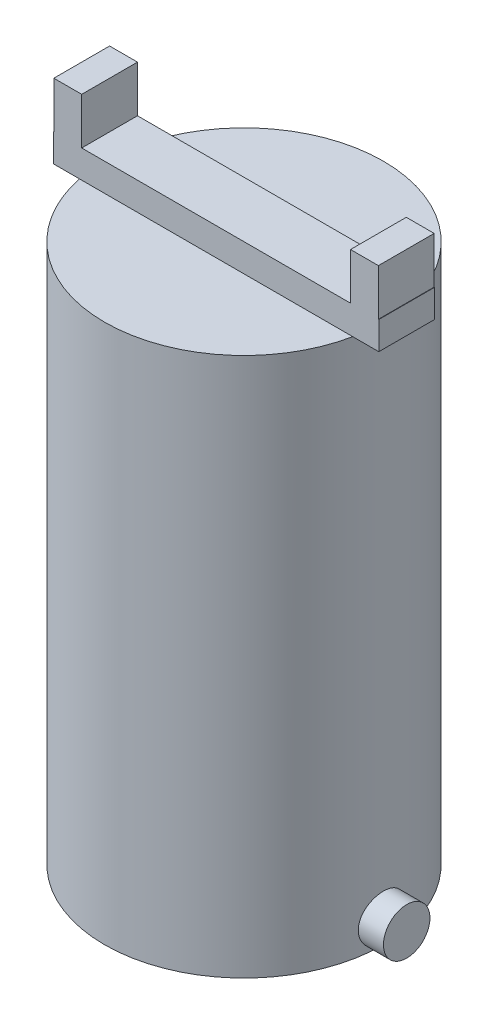
ISO-10303-21;
HEADER;
FILE_DESCRIPTION(('STEP AP214'),'2;1');
FILE_NAME('part.step','',(''),(''),'','','');
FILE_SCHEMA(('AUTOMOTIVE_DESIGN { 1 0 10303 214 1 1 1 1 }'));
ENDSEC;
DATA;
#1=APPLICATION_CONTEXT('core data for automotive mechanical design processes');
#2=APPLICATION_PROTOCOL_DEFINITION('international standard','automotive_design',2000,#1);
#3=PRODUCT_CONTEXT('',#1,'mechanical');
#4=PRODUCT('Part','Part','',(#3));
#5=PRODUCT_RELATED_PRODUCT_CATEGORY('part','',(#4));
#6=PRODUCT_DEFINITION_FORMATION('','',#4);
#7=PRODUCT_DEFINITION_CONTEXT('part definition',#1,'design');
#8=PRODUCT_DEFINITION('design','',#6,#7);
#9=PRODUCT_DEFINITION_SHAPE('','',#8);
#10=(LENGTH_UNIT() NAMED_UNIT(*) SI_UNIT(.MILLI.,.METRE.));
#11=(NAMED_UNIT(*) PLANE_ANGLE_UNIT() SI_UNIT($,.RADIAN.));
#12=(NAMED_UNIT(*) SI_UNIT($,.STERADIAN.) SOLID_ANGLE_UNIT());
#13=UNCERTAINTY_MEASURE_WITH_UNIT(LENGTH_MEASURE(1.E-05),#10,'distance_accuracy_value','');
#14=(GEOMETRIC_REPRESENTATION_CONTEXT(3) GLOBAL_UNCERTAINTY_ASSIGNED_CONTEXT((#13)) GLOBAL_UNIT_ASSIGNED_CONTEXT((#10,
#11,#12)) REPRESENTATION_CONTEXT('',''));
#15=CARTESIAN_POINT('',(0.,0.,0.));
#16=DIRECTION('',(0.,0.,1.));
#17=DIRECTION('',(1.,0.,0.));
#18=AXIS2_PLACEMENT_3D('',#15,#16,#17);
#19=CARTESIAN_POINT('',(0.,58.,0.));
#20=DIRECTION('',(0.,-1.,0.));
#21=DIRECTION('',(0.,0.,-1.));
#22=AXIS2_PLACEMENT_3D('',#19,#20,#21);
#23=CYLINDRICAL_SURFACE('',#22,15.);
#24=CARTESIAN_POINT('',(0.,58.,0.));
#25=DIRECTION('',(0.,1.,0.));
#26=DIRECTION('',(0.,0.,1.));
#27=AXIS2_PLACEMENT_3D('',#24,#25,#26);
#28=CIRCLE('',#27,15.);
#29=CARTESIAN_POINT('',(14.6969384566991,58.,3.));
#30=VERTEX_POINT('',#29);
#31=CARTESIAN_POINT('',(14.6969384566991,58.,-3.));
#32=VERTEX_POINT('',#31);
#33=EDGE_CURVE('E153',#30,#32,#28,.T.);
#34=ORIENTED_EDGE('',*,*,#33,.F.);
#35=CARTESIAN_POINT('',(-14.6969384566991,58.,3.));
#36=VERTEX_POINT('',#35);
#37=EDGE_CURVE('E151',#36,#30,#28,.T.);
#38=ORIENTED_EDGE('',*,*,#37,.F.);
#39=CARTESIAN_POINT('',(-14.6969384566991,58.,-3.));
#40=VERTEX_POINT('',#39);
#41=EDGE_CURVE('E152',#40,#36,#28,.T.);
#42=ORIENTED_EDGE('',*,*,#41,.F.);
#43=EDGE_CURVE('E158',#32,#40,#28,.T.);
#44=ORIENTED_EDGE('',*,*,#43,.F.);
#45=EDGE_LOOP('',(#34,#38,#42,#44));
#46=FACE_BOUND('',#45,.T.);
#47=CARTESIAN_POINT('',(0.,0.,0.));
#48=DIRECTION('',(0.,1.,0.));
#49=DIRECTION('',(0.,0.,1.));
#50=AXIS2_PLACEMENT_3D('',#47,#48,#49);
#51=CIRCLE('',#50,15.);
#52=CARTESIAN_POINT('',(15.,0.,0.));
#53=VERTEX_POINT('',#52);
#54=CARTESIAN_POINT('',(-15.,0.,0.));
#55=VERTEX_POINT('',#54);
#56=EDGE_CURVE('E37',#53,#55,#51,.T.);
#57=ORIENTED_EDGE('',*,*,#56,.T.);
#58=CARTESIAN_POINT('',(-15.,0.,0.));
#59=CARTESIAN_POINT('',(-14.9999976116882,5.58894783288313E-06,-0.139390904958215));
#60=CARTESIAN_POINT('',(-14.9980367791303,0.0116972749689239,-0.278857881838822));
#61=CARTESIAN_POINT('',(-14.9904034494139,0.0581356587653207,-0.553880221673044));
#62=CARTESIAN_POINT('',(-14.9847275392389,0.0929035569116028,-0.689431867959247));
#63=CARTESIAN_POINT('',(-14.9703006823645,0.184415448592755,-0.952604747212643));
#64=CARTESIAN_POINT('',(-14.9615522515919,0.241141465640574,-1.0802323684319));
#65=CARTESIAN_POINT('',(-14.9419422708207,0.374912292052395,-1.32414184197794));
#66=CARTESIAN_POINT('',(-14.9310809625443,0.451954777482997,-1.44042498987859));
#67=CARTESIAN_POINT('',(-14.9083331745831,0.624955083820459,-1.65947261429168));
#68=CARTESIAN_POINT('',(-14.8964387181486,0.721069114636129,-1.76211290353497));
#69=CARTESIAN_POINT('',(-14.8730262687673,0.929147968472811,-1.94988849865993));
#70=CARTESIAN_POINT('',(-14.8615082996267,1.04111379145661,-2.03502269939097));
#71=CARTESIAN_POINT('',(-14.8400756575978,1.27857096619706,-2.18586712560513));
#72=CARTESIAN_POINT('',(-14.8301712909164,1.40414133680476,-2.251454552861));
#73=CARTESIAN_POINT('',(-14.8131978979467,1.66470956430063,-2.36055836541122));
#74=CARTESIAN_POINT('',(-14.8061286801431,1.79970678367763,-2.40407624156561));
#75=CARTESIAN_POINT('',(-14.7957053684276,2.07398027485654,-2.46741437778481));
#76=CARTESIAN_POINT('',(-14.792317684857,2.21320573650139,-2.4874490291354));
#77=CARTESIAN_POINT('',(-14.7895393893665,2.49308027688347,-2.50391672528988));
#78=CARTESIAN_POINT('',(-14.7901484945721,2.6337292541673,-2.500351440389));
#79=CARTESIAN_POINT('',(-14.7952642886356,2.91092786127545,-2.46989509839615));
#80=CARTESIAN_POINT('',(-14.7997307331892,3.04750480354523,-2.44324488188977));
#81=CARTESIAN_POINT('',(-14.8119949521101,3.31422131782913,-2.36775314040345));
#82=CARTESIAN_POINT('',(-14.8197928407327,3.44436066888855,-2.31891085431974));
#83=CARTESIAN_POINT('',(-14.837884793341,3.69522882344092,-2.20017724609391));
#84=CARTESIAN_POINT('',(-14.8481906710733,3.81590940608123,-2.13018591387971));
#85=CARTESIAN_POINT('',(-14.8701291841501,4.04390440053838,-1.97121201755743));
#86=CARTESIAN_POINT('',(-14.8817619265429,4.15121773245493,-1.88222792065429));
#87=CARTESIAN_POINT('',(-14.9052202787979,4.35082608580735,-1.68648221215905));
#88=CARTESIAN_POINT('',(-14.9170464923165,4.44291851854008,-1.57951396387313));
#89=CARTESIAN_POINT('',(-14.9394260139672,4.60787776266534,-1.35153524898165));
#90=CARTESIAN_POINT('',(-14.9499793138975,4.68074445018323,-1.23052469190642));
#91=CARTESIAN_POINT('',(-14.9686389289291,4.80520222713628,-0.977705916166711));
#92=CARTESIAN_POINT('',(-14.9767431840745,4.85677541933126,-0.845888725564661));
#93=CARTESIAN_POINT('',(-14.9895750301266,4.93699421524598,-0.575298345602732));
#94=CARTESIAN_POINT('',(-14.9943029035047,4.96564173697372,-0.436525739179468));
#95=CARTESIAN_POINT('',(-14.9998112984269,4.99892135846113,-0.157709901301624));
#96=CARTESIAN_POINT('',(-15.0006375301278,5.00383157180561,-0.0177007371510118));
#97=CARTESIAN_POINT('',(-14.9983747442117,4.99023865557188,0.261139772889887));
#98=CARTESIAN_POINT('',(-14.9952858772412,4.97173642686626,0.399971163892038));
#99=CARTESIAN_POINT('',(-14.985568269382,4.91207515066452,0.671656175546763));
#100=CARTESIAN_POINT('',(-14.9789610480131,4.87105379160988,0.804540868385379));
#101=CARTESIAN_POINT('',(-14.9629446445536,4.76766548180047,1.06154688486044));
#102=CARTESIAN_POINT('',(-14.9535353051202,4.70529733236473,1.18566771590972));
#103=CARTESIAN_POINT('',(-14.9328451630241,4.56034887530321,1.42283068946896));
#104=CARTESIAN_POINT('',(-14.9215485588702,4.47759484383275,1.53576525093715));
#105=CARTESIAN_POINT('',(-14.898384673919,4.29446268461494,1.74624358550269));
#106=CARTESIAN_POINT('',(-14.8865173517155,4.19408327672333,1.84378623969658));
#107=CARTESIAN_POINT('',(-14.8634017523585,3.97730245192858,2.021742779658));
#108=CARTESIAN_POINT('',(-14.8521611613711,3.86074583448559,2.10196876111371));
#109=CARTESIAN_POINT('',(-14.8317152977788,3.61564703086146,2.24170231029499));
#110=CARTESIAN_POINT('',(-14.8225099606602,3.48710522477251,2.30121053476982));
#111=CARTESIAN_POINT('',(-14.807234536977,3.22221026718787,2.39753833147315));
#112=CARTESIAN_POINT('',(-14.8011515431106,3.08589190496951,2.43445143254795));
#113=CARTESIAN_POINT('',(-14.7927771683526,2.80887987077824,2.48483545377828));
#114=CARTESIAN_POINT('',(-14.7904854578272,2.66818658026795,2.49830841194617));
#115=CARTESIAN_POINT('',(-14.7899673308401,2.38829483403759,2.50137286604735));
#116=CARTESIAN_POINT('',(-14.7916905650565,2.24909962142471,2.49126013612519));
#117=CARTESIAN_POINT('',(-14.7988978145373,1.97442075194924,2.44807983895685));
#118=CARTESIAN_POINT('',(-14.8043818176121,1.83893708305813,2.41501234611248));
#119=CARTESIAN_POINT('',(-14.8184735628172,1.57564156270739,2.3269744895949));
#120=CARTESIAN_POINT('',(-14.8270776721967,1.44782098994398,2.27202959060044));
#121=CARTESIAN_POINT('',(-14.8464436892221,1.20316433080515,2.14182700391591));
#122=CARTESIAN_POINT('',(-14.857205703884,1.08632878962787,2.06656830874856));
#123=CARTESIAN_POINT('',(-14.8798345404562,0.865464416892247,1.89681888437216));
#124=CARTESIAN_POINT('',(-14.891712955763,0.761603983299729,1.80211056359365));
#125=CARTESIAN_POINT('',(-14.9151437236084,0.571148395525065,1.59660903138023));
#126=CARTESIAN_POINT('',(-14.9266960002655,0.484557231361829,1.48581211291264));
#127=CARTESIAN_POINT('',(-14.9482652964222,0.330551731800054,1.25036916964028));
#128=CARTESIAN_POINT('',(-14.958271162531,0.263273960687049,1.12563278753282));
#129=CARTESIAN_POINT('',(-14.9755116760178,0.15073051539008,0.866513069378981));
#130=CARTESIAN_POINT('',(-14.9827490817748,0.105442918920304,0.73213949483001));
#131=CARTESIAN_POINT('',(-14.9920579083296,0.0479947258733335,0.497703310045402));
#132=CARTESIAN_POINT('',(-14.9950202727336,0.0300255303840324,0.399058830298449));
#133=CARTESIAN_POINT('',(-14.9989921598612,0.0060262621552514,0.200289310319811));
#134=CARTESIAN_POINT('',(-15.0000017162064,-4.01613734925301E-06,0.100164295608495));
#135=CARTESIAN_POINT('',(-15.,0.,0.));
#136=B_SPLINE_CURVE_WITH_KNOTS('',3,(#58,#59,#60,#61,#62,#63,#64,#65,#66,#67,#68,#69,#70,#71,
#72,#73,#74,#75,#76,#77,#78,#79,#80,#81,#82,#83,#84,#85,#86,#87,#88,#89,#90,#91,#92,#93,#94,#95,
#96,#97,#98,#99,#100,#101,#102,#103,#104,#105,#106,#107,#108,#109,#110,#111,#112,#113,#114,#115,
#116,#117,#118,#119,#120,#121,#122,#123,#124,#125,#126,#127,#128,#129,#130,#131,#132,#133,#134,
#135),.UNSPECIFIED.,.T.,.F.,(4,2,2,2,2,2,2,2,2,2,2,2,2,2,2,2,2,2,2,2,2,2,2,2,2,2,2,2,2,2,2,2,2,
2,2,2,2,2,4),(0.,0.41780658493851,0.835997545695419,1.25384686702527,1.67164841267479,
2.09302491062332,2.51442800169857,2.9384252082384,3.36239376876181,3.78246077103424,
4.20249804320886,4.61820521760408,5.03392665025381,5.45164556632557,5.86939820680573,
6.29232769911326,6.71525991635847,7.13854688915903,7.56179844521149,7.98007883491397,
8.3983431303586,8.81407807006415,9.22983635826066,9.64926825627024,10.0687306305428,
10.4925382200762,10.9163323737594,11.3383602234177,11.7603513778662,12.177079095227,
12.5938054618813,13.0100481822622,13.4263115502934,13.8475138419339,14.2688133387897,
14.693022316072,15.1168075213007,15.4170424816402,15.7172722727697),.UNSPECIFIED.);
#137=EDGE_CURVE('E50',#55,#55,#136,.T.);
#138=ORIENTED_EDGE('',*,*,#137,.T.);
#139=EDGE_CURVE('E143',#55,#53,#51,.T.);
#140=ORIENTED_EDGE('',*,*,#139,.T.);
#141=CARTESIAN_POINT('',(15.,0.,0.));
#142=CARTESIAN_POINT('',(14.9999976116882,5.58894783288313E-06,-0.139390904958215));
#143=CARTESIAN_POINT('',(14.9980367791303,0.0116972749689239,-0.278857881838822));
#144=CARTESIAN_POINT('',(14.9904034494139,0.0581356587653207,-0.553880221673044));
#145=CARTESIAN_POINT('',(14.9847275392389,0.0929035569116028,-0.689431867959247));
#146=CARTESIAN_POINT('',(14.9703006823645,0.184415448592755,-0.952604747212643));
#147=CARTESIAN_POINT('',(14.9615522515919,0.241141465640574,-1.0802323684319));
#148=CARTESIAN_POINT('',(14.9419422708207,0.374912292052395,-1.32414184197794));
#149=CARTESIAN_POINT('',(14.9310809625443,0.451954777482997,-1.44042498987859));
#150=CARTESIAN_POINT('',(14.9083331745831,0.624955083820459,-1.65947261429168));
#151=CARTESIAN_POINT('',(14.8964387181486,0.721069114636129,-1.76211290353497));
#152=CARTESIAN_POINT('',(14.8730262687673,0.929147968472811,-1.94988849865993));
#153=CARTESIAN_POINT('',(14.8615082996267,1.04111379145661,-2.03502269939097));
#154=CARTESIAN_POINT('',(14.8400756575978,1.27857096619706,-2.18586712560513));
#155=CARTESIAN_POINT('',(14.8301712909164,1.40414133680476,-2.251454552861));
#156=CARTESIAN_POINT('',(14.8131978979467,1.66470956430063,-2.36055836541122));
#157=CARTESIAN_POINT('',(14.8061286801431,1.79970678367763,-2.40407624156561));
#158=CARTESIAN_POINT('',(14.7957053684276,2.07398027485654,-2.46741437778481));
#159=CARTESIAN_POINT('',(14.792317684857,2.21320573650139,-2.4874490291354));
#160=CARTESIAN_POINT('',(14.7895393893665,2.49308027688347,-2.50391672528988));
#161=CARTESIAN_POINT('',(14.7901484945721,2.6337292541673,-2.500351440389));
#162=CARTESIAN_POINT('',(14.7952642886356,2.91092786127545,-2.46989509839615));
#163=CARTESIAN_POINT('',(14.7997307331892,3.04750480354523,-2.44324488188977));
#164=CARTESIAN_POINT('',(14.8119949521101,3.31422131782913,-2.36775314040345));
#165=CARTESIAN_POINT('',(14.8197928407327,3.44436066888855,-2.31891085431974));
#166=CARTESIAN_POINT('',(14.837884793341,3.69522882344092,-2.20017724609391));
#167=CARTESIAN_POINT('',(14.8481906710733,3.81590940608123,-2.13018591387971));
#168=CARTESIAN_POINT('',(14.8701291841501,4.04390440053838,-1.97121201755743));
#169=CARTESIAN_POINT('',(14.8817619265429,4.15121773245493,-1.88222792065429));
#170=CARTESIAN_POINT('',(14.9052202787979,4.35082608580735,-1.68648221215905));
#171=CARTESIAN_POINT('',(14.9170464923165,4.44291851854008,-1.57951396387313));
#172=CARTESIAN_POINT('',(14.9394260139672,4.60787776266534,-1.35153524898165));
#173=CARTESIAN_POINT('',(14.9499793138975,4.68074445018323,-1.23052469190642));
#174=CARTESIAN_POINT('',(14.9686389289291,4.80520222713628,-0.977705916166711));
#175=CARTESIAN_POINT('',(14.9767431840745,4.85677541933126,-0.845888725564661));
#176=CARTESIAN_POINT('',(14.9895750301266,4.93699421524598,-0.575298345602732));
#177=CARTESIAN_POINT('',(14.9943029035047,4.96564173697372,-0.436525739179468));
#178=CARTESIAN_POINT('',(14.9998112984269,4.99892135846113,-0.157709901301624));
#179=CARTESIAN_POINT('',(15.0006375301278,5.00383157180561,-0.0177007371510118));
#180=CARTESIAN_POINT('',(14.9983747442117,4.99023865557188,0.261139772889887));
#181=CARTESIAN_POINT('',(14.9952858772412,4.97173642686626,0.399971163892038));
#182=CARTESIAN_POINT('',(14.985568269382,4.91207515066452,0.671656175546763));
#183=CARTESIAN_POINT('',(14.9789610480131,4.87105379160988,0.804540868385379));
#184=CARTESIAN_POINT('',(14.9629446445536,4.76766548180047,1.06154688486044));
#185=CARTESIAN_POINT('',(14.9535353051202,4.70529733236473,1.18566771590972));
#186=CARTESIAN_POINT('',(14.9328451630241,4.56034887530321,1.42283068946896));
#187=CARTESIAN_POINT('',(14.9215485588702,4.47759484383275,1.53576525093715));
#188=CARTESIAN_POINT('',(14.898384673919,4.29446268461494,1.74624358550269));
#189=CARTESIAN_POINT('',(14.8865173517155,4.19408327672333,1.84378623969658));
#190=CARTESIAN_POINT('',(14.8634017523585,3.97730245192858,2.021742779658));
#191=CARTESIAN_POINT('',(14.8521611613711,3.86074583448559,2.10196876111371));
#192=CARTESIAN_POINT('',(14.8317152977788,3.61564703086146,2.24170231029499));
#193=CARTESIAN_POINT('',(14.8225099606602,3.48710522477251,2.30121053476982));
#194=CARTESIAN_POINT('',(14.807234536977,3.22221026718787,2.39753833147315));
#195=CARTESIAN_POINT('',(14.8011515431106,3.08589190496951,2.43445143254795));
#196=CARTESIAN_POINT('',(14.7927771683526,2.80887987077824,2.48483545377828));
#197=CARTESIAN_POINT('',(14.7904854578272,2.66818658026795,2.49830841194617));
#198=CARTESIAN_POINT('',(14.7899673308401,2.38829483403759,2.50137286604735));
#199=CARTESIAN_POINT('',(14.7916905650565,2.24909962142471,2.49126013612519));
#200=CARTESIAN_POINT('',(14.7988978145373,1.97442075194924,2.44807983895685));
#201=CARTESIAN_POINT('',(14.8043818176121,1.83893708305813,2.41501234611248));
#202=CARTESIAN_POINT('',(14.8184735628172,1.57564156270739,2.3269744895949));
#203=CARTESIAN_POINT('',(14.8270776721967,1.44782098994398,2.27202959060044));
#204=CARTESIAN_POINT('',(14.8464436892221,1.20316433080515,2.14182700391591));
#205=CARTESIAN_POINT('',(14.857205703884,1.08632878962787,2.06656830874856));
#206=CARTESIAN_POINT('',(14.8798345404562,0.865464416892247,1.89681888437216));
#207=CARTESIAN_POINT('',(14.891712955763,0.761603983299729,1.80211056359365));
#208=CARTESIAN_POINT('',(14.9151437236084,0.571148395525065,1.59660903138023));
#209=CARTESIAN_POINT('',(14.9266960002655,0.484557231361829,1.48581211291264));
#210=CARTESIAN_POINT('',(14.9482652964222,0.330551731800054,1.25036916964028));
#211=CARTESIAN_POINT('',(14.958271162531,0.263273960687049,1.12563278753282));
#212=CARTESIAN_POINT('',(14.9755116760178,0.15073051539008,0.866513069378981));
#213=CARTESIAN_POINT('',(14.9827490817748,0.105442918920304,0.73213949483001));
#214=CARTESIAN_POINT('',(14.9920579083296,0.0479947258733335,0.497703310045402));
#215=CARTESIAN_POINT('',(14.9950202727336,0.0300255303840324,0.399058830298449));
#216=CARTESIAN_POINT('',(14.9989921598612,0.0060262621552514,0.200289310319811));
#217=CARTESIAN_POINT('',(15.0000017162064,-4.01613734925301E-06,0.100164295608495));
#218=CARTESIAN_POINT('',(15.,0.,0.));
#219=B_SPLINE_CURVE_WITH_KNOTS('',3,(#141,#142,#143,#144,#145,#146,#147,#148,#149,#150,#151,
#152,#153,#154,#155,#156,#157,#158,#159,#160,#161,#162,#163,#164,#165,#166,#167,#168,#169,#170,
#171,#172,#173,#174,#175,#176,#177,#178,#179,#180,#181,#182,#183,#184,#185,#186,#187,#188,#189,
#190,#191,#192,#193,#194,#195,#196,#197,#198,#199,#200,#201,#202,#203,#204,#205,#206,#207,#208,
#209,#210,#211,#212,#213,#214,#215,#216,#217,#218),.UNSPECIFIED.,.T.,.F.,(4,2,2,2,2,2,2,2,2,2,2,
2,2,2,2,2,2,2,2,2,2,2,2,2,2,2,2,2,2,2,2,2,2,2,2,2,2,2,4),(0.,0.41780658493851,0.835997545695419,
1.25384686702527,1.67164841267479,2.09302491062332,2.51442800169857,2.9384252082384,
3.36239376876181,3.78246077103424,4.20249804320886,4.61820521760408,5.03392665025381,
5.45164556632557,5.86939820680573,6.29232769911326,6.71525991635847,7.13854688915903,
7.56179844521149,7.98007883491397,8.3983431303586,8.81407807006415,9.22983635826066,
9.64926825627024,10.0687306305428,10.4925382200762,10.9163323737594,11.3383602234177,
11.7603513778662,12.177079095227,12.5938054618813,13.0100481822622,13.4263115502934,
13.8475138419339,14.2688133387897,14.693022316072,15.1168075213007,15.4170424816402,
15.7172722727697),.UNSPECIFIED.);
#220=EDGE_CURVE('E147',#53,#53,#219,.T.);
#221=ORIENTED_EDGE('',*,*,#220,.F.);
#222=EDGE_LOOP('',(#57,#138,#140,#221));
#223=FACE_BOUND('',#222,.T.);
#224=ADVANCED_FACE('F33',(#46,#223),#23,.T.);
#225=CARTESIAN_POINT('',(0.,61.,0.));
#226=DIRECTION('',(0.,1.,0.));
#227=DIRECTION('',(0.,0.,1.));
#228=AXIS2_PLACEMENT_3D('',#225,#226,#227);
#229=PLANE('',#228);
#230=DIRECTION('',(0.,0.,-1.));
#231=VECTOR('',#230,1.);
#232=CARTESIAN_POINT('',(14.4574550303839,61.,-3.));
#233=LINE('',#232,#231);
#234=CARTESIAN_POINT('',(14.4574550303839,61.,3.));
#235=VERTEX_POINT('',#234);
#236=CARTESIAN_POINT('',(14.4574550303839,61.,-3.));
#237=VERTEX_POINT('',#236);
#238=EDGE_CURVE('E57',#235,#237,#233,.T.);
#239=ORIENTED_EDGE('',*,*,#238,.T.);
#240=DIRECTION('',(-1.,0.,0.));
#241=VECTOR('',#240,1.);
#242=CARTESIAN_POINT('',(-17.5,61.,-3.));
#243=LINE('',#242,#241);
#244=CARTESIAN_POINT('',(-14.4574550303839,61.,-3.));
#245=VERTEX_POINT('',#244);
#246=EDGE_CURVE('E214',#237,#245,#243,.T.);
#247=ORIENTED_EDGE('',*,*,#246,.T.);
#248=DIRECTION('',(0.,0.,-1.));
#249=VECTOR('',#248,1.);
#250=CARTESIAN_POINT('',(-14.4574550303839,61.,-3.));
#251=LINE('',#250,#249);
#252=CARTESIAN_POINT('',(-14.4574550303839,61.,3.));
#253=VERTEX_POINT('',#252);
#254=EDGE_CURVE('E279',#253,#245,#251,.T.);
#255=ORIENTED_EDGE('',*,*,#254,.F.);
#256=DIRECTION('',(1.,0.,0.));
#257=VECTOR('',#256,1.);
#258=CARTESIAN_POINT('',(-17.5,61.,3.));
#259=LINE('',#258,#257);
#260=EDGE_CURVE('E236',#253,#235,#259,.T.);
#261=ORIENTED_EDGE('',*,*,#260,.T.);
#262=EDGE_LOOP('',(#239,#247,#255,#261));
#263=FACE_BOUND('',#262,.T.);
#264=ADVANCED_FACE('F258',(#263),#229,.T.);
#265=DIRECTION('',(0.,0.,1.));
#266=VECTOR('',#265,1.);
#267=CARTESIAN_POINT('',(17.4574550303839,61.,-3.));
#268=LINE('',#267,#266);
#269=CARTESIAN_POINT('',(17.4574550303838,61.,-3.));
#270=VERTEX_POINT('',#269);
#271=CARTESIAN_POINT('',(17.4574550303839,61.,3.));
#272=VERTEX_POINT('',#271);
#273=EDGE_CURVE('E244',#270,#272,#268,.T.);
#274=ORIENTED_EDGE('',*,*,#273,.T.);
#275=CARTESIAN_POINT('',(17.5,61.,3.));
#276=VERTEX_POINT('',#275);
#277=EDGE_CURVE('E235',#272,#276,#259,.T.);
#278=ORIENTED_EDGE('',*,*,#277,.T.);
#279=DIRECTION('',(0.,0.,-1.));
#280=VECTOR('',#279,1.);
#281=CARTESIAN_POINT('',(17.5,61.,-3.));
#282=LINE('',#281,#280);
#283=CARTESIAN_POINT('',(17.5,61.,-3.));
#284=VERTEX_POINT('',#283);
#285=EDGE_CURVE('E193',#276,#284,#282,.T.);
#286=ORIENTED_EDGE('',*,*,#285,.T.);
#287=EDGE_CURVE('E216',#284,#270,#243,.T.);
#288=ORIENTED_EDGE('',*,*,#287,.T.);
#289=EDGE_LOOP('',(#274,#278,#286,#288));
#290=FACE_BOUND('',#289,.T.);
#291=ADVANCED_FACE('F241',(#290),#229,.T.);
#292=CARTESIAN_POINT('',(0.,58.,0.));
#293=DIRECTION('',(0.,1.,0.));
#294=DIRECTION('',(0.,0.,1.));
#295=AXIS2_PLACEMENT_3D('',#292,#293,#294);
#296=PLANE('',#295);
#297=DIRECTION('',(1.,0.,0.));
#298=VECTOR('',#297,1.);
#299=CARTESIAN_POINT('',(-17.5,58.,3.));
#300=LINE('',#299,#298);
#301=EDGE_CURVE('E11',#36,#30,#300,.T.);
#302=ORIENTED_EDGE('',*,*,#301,.F.);
#303=ORIENTED_EDGE('',*,*,#37,.T.);
#304=EDGE_LOOP('',(#302,#303));
#305=FACE_BOUND('',#304,.T.);
#306=ADVANCED_FACE('F251',(#305),#296,.T.);
#307=DIRECTION('',(-1.,0.,0.));
#308=VECTOR('',#307,1.);
#309=CARTESIAN_POINT('',(-17.5,58.,-3.));
#310=LINE('',#309,#308);
#311=EDGE_CURVE('E42',#32,#40,#310,.T.);
#312=ORIENTED_EDGE('',*,*,#311,.F.);
#313=ORIENTED_EDGE('',*,*,#43,.T.);
#314=EDGE_LOOP('',(#312,#313));
#315=FACE_BOUND('',#314,.T.);
#316=ADVANCED_FACE('F171',(#315),#296,.T.);
#317=CARTESIAN_POINT('',(0.,0.,0.));
#318=DIRECTION('',(0.,1.,0.));
#319=DIRECTION('',(0.,0.,1.));
#320=AXIS2_PLACEMENT_3D('',#317,#318,#319);
#321=PLANE('',#320);
#322=ORIENTED_EDGE('',*,*,#56,.F.);
#323=ORIENTED_EDGE('',*,*,#139,.F.);
#324=EDGE_LOOP('',(#322,#323));
#325=FACE_BOUND('',#324,.T.);
#326=ADVANCED_FACE('F150',(#325),#321,.F.);
#327=CARTESIAN_POINT('',(0.,58.,0.));
#328=DIRECTION('',(0.,1.,0.));
#329=DIRECTION('',(0.,0.,1.));
#330=AXIS2_PLACEMENT_3D('',#327,#328,#329);
#331=PLANE('',#330);
#332=CARTESIAN_POINT('',(17.5,58.,3.));
#333=VERTEX_POINT('',#332);
#334=EDGE_CURVE('E45',#30,#333,#300,.T.);
#335=ORIENTED_EDGE('',*,*,#334,.F.);
#336=ORIENTED_EDGE('',*,*,#33,.T.);
#337=CARTESIAN_POINT('',(17.5,58.,-3.));
#338=VERTEX_POINT('',#337);
#339=EDGE_CURVE('E166',#338,#32,#310,.T.);
#340=ORIENTED_EDGE('',*,*,#339,.F.);
#341=DIRECTION('',(0.,0.,-1.));
#342=VECTOR('',#341,1.);
#343=CARTESIAN_POINT('',(17.5,58.,-3.));
#344=LINE('',#343,#342);
#345=EDGE_CURVE('E183',#333,#338,#344,.T.);
#346=ORIENTED_EDGE('',*,*,#345,.F.);
#347=EDGE_LOOP('',(#335,#336,#340,#346));
#348=FACE_BOUND('',#347,.T.);
#349=ADVANCED_FACE('F250',(#348),#331,.F.);
#350=CARTESIAN_POINT('',(-17.5,58.,-3.));
#351=VERTEX_POINT('',#350);
#352=EDGE_CURVE('E167',#40,#351,#310,.T.);
#353=ORIENTED_EDGE('',*,*,#352,.F.);
#354=ORIENTED_EDGE('',*,*,#41,.T.);
#355=CARTESIAN_POINT('',(-17.5,58.,3.));
#356=VERTEX_POINT('',#355);
#357=EDGE_CURVE('E44',#356,#36,#300,.T.);
#358=ORIENTED_EDGE('',*,*,#357,.F.);
#359=DIRECTION('',(0.,0.,1.));
#360=VECTOR('',#359,1.);
#361=CARTESIAN_POINT('',(-17.5,58.,-3.));
#362=LINE('',#361,#360);
#363=EDGE_CURVE('E179',#351,#356,#362,.T.);
#364=ORIENTED_EDGE('',*,*,#363,.F.);
#365=EDGE_LOOP('',(#353,#354,#358,#364));
#366=FACE_BOUND('',#365,.T.);
#367=ADVANCED_FACE('F178',(#366),#331,.F.);
#368=CARTESIAN_POINT('',(17.5,61.,-3.));
#369=DIRECTION('',(-1.,0.,0.));
#370=DIRECTION('',(0.,0.,1.));
#371=AXIS2_PLACEMENT_3D('',#368,#369,#370);
#372=PLANE('',#371);
#373=ORIENTED_EDGE('',*,*,#345,.T.);
#374=DIRECTION('',(0.,-1.,0.));
#375=VECTOR('',#374,1.);
#376=CARTESIAN_POINT('',(17.5,61.,-3.));
#377=LINE('',#376,#375);
#378=EDGE_CURVE('E149',#284,#338,#377,.T.);
#379=ORIENTED_EDGE('',*,*,#378,.F.);
#380=ORIENTED_EDGE('',*,*,#285,.F.);
#381=DIRECTION('',(0.,-1.,0.));
#382=VECTOR('',#381,1.);
#383=CARTESIAN_POINT('',(17.5,61.,3.));
#384=LINE('',#383,#382);
#385=EDGE_CURVE('E194',#276,#333,#384,.T.);
#386=ORIENTED_EDGE('',*,*,#385,.T.);
#387=EDGE_LOOP('',(#373,#379,#380,#386));
#388=FACE_BOUND('',#387,.T.);
#389=ADVANCED_FACE('F249',(#388),#372,.F.);
#390=CARTESIAN_POINT('',(-17.5,61.,-3.));
#391=DIRECTION('',(0.,0.,1.));
#392=DIRECTION('',(1.,0.,0.));
#393=AXIS2_PLACEMENT_3D('',#390,#391,#392);
#394=PLANE('',#393);
#395=ORIENTED_EDGE('',*,*,#339,.T.);
#396=ORIENTED_EDGE('',*,*,#311,.T.);
#397=ORIENTED_EDGE('',*,*,#352,.T.);
#398=DIRECTION('',(0.,-1.,0.));
#399=VECTOR('',#398,1.);
#400=CARTESIAN_POINT('',(-17.5,61.,-3.));
#401=LINE('',#400,#399);
#402=CARTESIAN_POINT('',(-17.5,61.,-3.));
#403=VERTEX_POINT('',#402);
#404=EDGE_CURVE('E201',#403,#351,#401,.T.);
#405=ORIENTED_EDGE('',*,*,#404,.F.);
#406=CARTESIAN_POINT('',(-17.4574550303839,61.,-3.));
#407=VERTEX_POINT('',#406);
#408=EDGE_CURVE('E209',#407,#403,#243,.T.);
#409=ORIENTED_EDGE('',*,*,#408,.F.);
#410=DIRECTION('',(0.,-1.,0.));
#411=VECTOR('',#410,1.);
#412=CARTESIAN_POINT('',(-17.4574550303839,66.,-3.));
#413=LINE('',#412,#411);
#414=CARTESIAN_POINT('',(-17.4574550303839,66.,-3.));
#415=VERTEX_POINT('',#414);
#416=EDGE_CURVE('E211',#415,#407,#413,.T.);
#417=ORIENTED_EDGE('',*,*,#416,.F.);
#418=DIRECTION('',(-1.,0.,0.));
#419=VECTOR('',#418,1.);
#420=CARTESIAN_POINT('',(-17.4574550303839,66.,-3.));
#421=LINE('',#420,#419);
#422=CARTESIAN_POINT('',(-14.4574550303839,66.,-3.));
#423=VERTEX_POINT('',#422);
#424=EDGE_CURVE('E282',#423,#415,#421,.T.);
#425=ORIENTED_EDGE('',*,*,#424,.F.);
#426=DIRECTION('',(0.,-1.,0.));
#427=VECTOR('',#426,1.);
#428=CARTESIAN_POINT('',(-14.4574550303839,66.,-3.));
#429=LINE('',#428,#427);
#430=EDGE_CURVE('E224',#423,#245,#429,.T.);
#431=ORIENTED_EDGE('',*,*,#430,.T.);
#432=ORIENTED_EDGE('',*,*,#246,.F.);
#433=DIRECTION('',(0.,-1.,0.));
#434=VECTOR('',#433,1.);
#435=CARTESIAN_POINT('',(14.4574550303839,66.,-3.));
#436=LINE('',#435,#434);
#437=CARTESIAN_POINT('',(14.4574550303839,66.,-3.));
#438=VERTEX_POINT('',#437);
#439=EDGE_CURVE('E304',#438,#237,#436,.T.);
#440=ORIENTED_EDGE('',*,*,#439,.F.);
#441=DIRECTION('',(1.,0.,0.));
#442=VECTOR('',#441,1.);
#443=CARTESIAN_POINT('',(17.4574550303839,66.,-3.));
#444=LINE('',#443,#442);
#445=CARTESIAN_POINT('',(17.4574550303839,66.,-3.));
#446=VERTEX_POINT('',#445);
#447=EDGE_CURVE('E307',#438,#446,#444,.T.);
#448=ORIENTED_EDGE('',*,*,#447,.T.);
#449=DIRECTION('',(0.,-1.,0.));
#450=VECTOR('',#449,1.);
#451=CARTESIAN_POINT('',(17.4574550303839,66.,-3.));
#452=LINE('',#451,#450);
#453=EDGE_CURVE('E301',#446,#270,#452,.T.);
#454=ORIENTED_EDGE('',*,*,#453,.T.);
#455=ORIENTED_EDGE('',*,*,#287,.F.);
#456=ORIENTED_EDGE('',*,*,#378,.T.);
#457=EDGE_LOOP('',(#395,#396,#397,#405,#409,#417,#425,#431,#432,#440,#448,#454,#455,#456));
#458=FACE_BOUND('',#457,.T.);
#459=ADVANCED_FACE('F184',(#458),#394,.F.);
#460=CARTESIAN_POINT('',(-17.5,61.,-3.));
#461=DIRECTION('',(1.,0.,0.));
#462=DIRECTION('',(0.,0.,-1.));
#463=AXIS2_PLACEMENT_3D('',#460,#461,#462);
#464=PLANE('',#463);
#465=ORIENTED_EDGE('',*,*,#363,.T.);
#466=DIRECTION('',(0.,-1.,0.));
#467=VECTOR('',#466,1.);
#468=CARTESIAN_POINT('',(-17.5,61.,3.));
#469=LINE('',#468,#467);
#470=CARTESIAN_POINT('',(-17.5,61.,3.));
#471=VERTEX_POINT('',#470);
#472=EDGE_CURVE('E197',#471,#356,#469,.T.);
#473=ORIENTED_EDGE('',*,*,#472,.F.);
#474=DIRECTION('',(0.,0.,1.));
#475=VECTOR('',#474,1.);
#476=CARTESIAN_POINT('',(-17.5,61.,-3.));
#477=LINE('',#476,#475);
#478=EDGE_CURVE('E206',#403,#471,#477,.T.);
#479=ORIENTED_EDGE('',*,*,#478,.F.);
#480=ORIENTED_EDGE('',*,*,#404,.T.);
#481=EDGE_LOOP('',(#465,#473,#479,#480));
#482=FACE_BOUND('',#481,.T.);
#483=ADVANCED_FACE('F204',(#482),#464,.F.);
#484=CARTESIAN_POINT('',(-17.5,61.,3.));
#485=DIRECTION('',(0.,0.,-1.));
#486=DIRECTION('',(-1.,0.,0.));
#487=AXIS2_PLACEMENT_3D('',#484,#485,#486);
#488=PLANE('',#487);
#489=ORIENTED_EDGE('',*,*,#357,.T.);
#490=ORIENTED_EDGE('',*,*,#301,.T.);
#491=ORIENTED_EDGE('',*,*,#334,.T.);
#492=ORIENTED_EDGE('',*,*,#385,.F.);
#493=ORIENTED_EDGE('',*,*,#277,.F.);
#494=DIRECTION('',(0.,-1.,0.));
#495=VECTOR('',#494,1.);
#496=CARTESIAN_POINT('',(17.4574550303839,66.,3.));
#497=LINE('',#496,#495);
#498=CARTESIAN_POINT('',(17.4574550303839,66.,3.));
#499=VERTEX_POINT('',#498);
#500=EDGE_CURVE('E299',#499,#272,#497,.T.);
#501=ORIENTED_EDGE('',*,*,#500,.F.);
#502=DIRECTION('',(-1.,0.,0.));
#503=VECTOR('',#502,1.);
#504=CARTESIAN_POINT('',(17.4574550303839,66.,3.));
#505=LINE('',#504,#503);
#506=CARTESIAN_POINT('',(14.4574550303839,66.,3.));
#507=VERTEX_POINT('',#506);
#508=EDGE_CURVE('E316',#499,#507,#505,.T.);
#509=ORIENTED_EDGE('',*,*,#508,.T.);
#510=DIRECTION('',(0.,-1.,0.));
#511=VECTOR('',#510,1.);
#512=CARTESIAN_POINT('',(14.4574550303839,66.,3.));
#513=LINE('',#512,#511);
#514=EDGE_CURVE('E285',#507,#235,#513,.T.);
#515=ORIENTED_EDGE('',*,*,#514,.T.);
#516=ORIENTED_EDGE('',*,*,#260,.F.);
#517=DIRECTION('',(0.,-1.,0.));
#518=VECTOR('',#517,1.);
#519=CARTESIAN_POINT('',(-14.4574550303839,66.,3.));
#520=LINE('',#519,#518);
#521=CARTESIAN_POINT('',(-14.4574550303839,66.,3.));
#522=VERTEX_POINT('',#521);
#523=EDGE_CURVE('E229',#522,#253,#520,.T.);
#524=ORIENTED_EDGE('',*,*,#523,.F.);
#525=DIRECTION('',(1.,0.,0.));
#526=VECTOR('',#525,1.);
#527=CARTESIAN_POINT('',(-17.4574550303839,66.,3.));
#528=LINE('',#527,#526);
#529=CARTESIAN_POINT('',(-17.4574550303839,66.,3.));
#530=VERTEX_POINT('',#529);
#531=EDGE_CURVE('E289',#530,#522,#528,.T.);
#532=ORIENTED_EDGE('',*,*,#531,.F.);
#533=DIRECTION('',(0.,-1.,0.));
#534=VECTOR('',#533,1.);
#535=CARTESIAN_POINT('',(-17.4574550303839,66.,3.));
#536=LINE('',#535,#534);
#537=CARTESIAN_POINT('',(-17.4574550303839,61.,3.));
#538=VERTEX_POINT('',#537);
#539=EDGE_CURVE('E225',#530,#538,#536,.T.);
#540=ORIENTED_EDGE('',*,*,#539,.T.);
#541=EDGE_CURVE('E198',#471,#538,#259,.T.);
#542=ORIENTED_EDGE('',*,*,#541,.F.);
#543=ORIENTED_EDGE('',*,*,#472,.T.);
#544=EDGE_LOOP('',(#489,#490,#491,#492,#493,#501,#509,#515,#516,#524,#532,#540,#542,#543));
#545=FACE_BOUND('',#544,.T.);
#546=ADVANCED_FACE('F247',(#545),#488,.F.);
#547=DIRECTION('',(0.,0.,1.));
#548=VECTOR('',#547,1.);
#549=CARTESIAN_POINT('',(-17.4574550303839,61.,-3.));
#550=LINE('',#549,#548);
#551=EDGE_CURVE('E221',#407,#538,#550,.T.);
#552=ORIENTED_EDGE('',*,*,#551,.F.);
#553=ORIENTED_EDGE('',*,*,#408,.T.);
#554=ORIENTED_EDGE('',*,*,#478,.T.);
#555=ORIENTED_EDGE('',*,*,#541,.T.);
#556=EDGE_LOOP('',(#552,#553,#554,#555));
#557=FACE_BOUND('',#556,.T.);
#558=ADVANCED_FACE('F260',(#557),#229,.T.);
#559=CARTESIAN_POINT('',(-14.4574550303839,66.,-3.));
#560=DIRECTION('',(-1.,0.,0.));
#561=DIRECTION('',(0.,0.,1.));
#562=AXIS2_PLACEMENT_3D('',#559,#560,#561);
#563=PLANE('',#562);
#564=ORIENTED_EDGE('',*,*,#254,.T.);
#565=ORIENTED_EDGE('',*,*,#430,.F.);
#566=DIRECTION('',(0.,0.,-1.));
#567=VECTOR('',#566,1.);
#568=CARTESIAN_POINT('',(-14.4574550303839,66.,-3.));
#569=LINE('',#568,#567);
#570=EDGE_CURVE('E278',#522,#423,#569,.T.);
#571=ORIENTED_EDGE('',*,*,#570,.F.);
#572=ORIENTED_EDGE('',*,*,#523,.T.);
#573=EDGE_LOOP('',(#564,#565,#571,#572));
#574=FACE_BOUND('',#573,.T.);
#575=ADVANCED_FACE('F271',(#574),#563,.F.);
#576=CARTESIAN_POINT('',(-17.4574550303839,66.,-3.));
#577=DIRECTION('',(1.,0.,0.));
#578=DIRECTION('',(0.,0.,-1.));
#579=AXIS2_PLACEMENT_3D('',#576,#577,#578);
#580=PLANE('',#579);
#581=ORIENTED_EDGE('',*,*,#551,.T.);
#582=ORIENTED_EDGE('',*,*,#539,.F.);
#583=DIRECTION('',(0.,0.,1.));
#584=VECTOR('',#583,1.);
#585=CARTESIAN_POINT('',(-17.4574550303839,66.,-3.));
#586=LINE('',#585,#584);
#587=EDGE_CURVE('E223',#415,#530,#586,.T.);
#588=ORIENTED_EDGE('',*,*,#587,.F.);
#589=ORIENTED_EDGE('',*,*,#416,.T.);
#590=EDGE_LOOP('',(#581,#582,#588,#589));
#591=FACE_BOUND('',#590,.T.);
#592=ADVANCED_FACE('F219',(#591),#580,.F.);
#593=CARTESIAN_POINT('',(0.,66.,0.));
#594=DIRECTION('',(0.,1.,0.));
#595=DIRECTION('',(0.,0.,1.));
#596=AXIS2_PLACEMENT_3D('',#593,#594,#595);
#597=PLANE('',#596);
#598=ORIENTED_EDGE('',*,*,#570,.T.);
#599=ORIENTED_EDGE('',*,*,#424,.T.);
#600=ORIENTED_EDGE('',*,*,#587,.T.);
#601=ORIENTED_EDGE('',*,*,#531,.T.);
#602=EDGE_LOOP('',(#598,#599,#600,#601));
#603=FACE_BOUND('',#602,.T.);
#604=ADVANCED_FACE('F347',(#603),#597,.T.);
#605=CARTESIAN_POINT('',(14.4574550303839,66.,-3.));
#606=DIRECTION('',(-1.,0.,0.));
#607=DIRECTION('',(0.,0.,1.));
#608=AXIS2_PLACEMENT_3D('',#605,#606,#607);
#609=PLANE('',#608);
#610=ORIENTED_EDGE('',*,*,#238,.F.);
#611=ORIENTED_EDGE('',*,*,#514,.F.);
#612=DIRECTION('',(0.,0.,-1.));
#613=VECTOR('',#612,1.);
#614=CARTESIAN_POINT('',(14.4574550303839,66.,-3.));
#615=LINE('',#614,#613);
#616=EDGE_CURVE('E309',#507,#438,#615,.T.);
#617=ORIENTED_EDGE('',*,*,#616,.T.);
#618=ORIENTED_EDGE('',*,*,#439,.T.);
#619=EDGE_LOOP('',(#610,#611,#617,#618));
#620=FACE_BOUND('',#619,.T.);
#621=ADVANCED_FACE('F343',(#620),#609,.T.);
#622=CARTESIAN_POINT('',(17.4574550303839,66.,-3.));
#623=DIRECTION('',(1.,0.,0.));
#624=DIRECTION('',(0.,0.,-1.));
#625=AXIS2_PLACEMENT_3D('',#622,#623,#624);
#626=PLANE('',#625);
#627=ORIENTED_EDGE('',*,*,#273,.F.);
#628=ORIENTED_EDGE('',*,*,#453,.F.);
#629=DIRECTION('',(0.,0.,1.));
#630=VECTOR('',#629,1.);
#631=CARTESIAN_POINT('',(17.4574550303839,66.,-3.));
#632=LINE('',#631,#630);
#633=EDGE_CURVE('E313',#446,#499,#632,.T.);
#634=ORIENTED_EDGE('',*,*,#633,.T.);
#635=ORIENTED_EDGE('',*,*,#500,.T.);
#636=EDGE_LOOP('',(#627,#628,#634,#635));
#637=FACE_BOUND('',#636,.T.);
#638=ADVANCED_FACE('F339',(#637),#626,.T.);
#639=CARTESIAN_POINT('',(0.,66.,0.));
#640=DIRECTION('',(0.,1.,0.));
#641=DIRECTION('',(0.,0.,1.));
#642=AXIS2_PLACEMENT_3D('',#639,#640,#641);
#643=PLANE('',#642);
#644=ORIENTED_EDGE('',*,*,#616,.F.);
#645=ORIENTED_EDGE('',*,*,#508,.F.);
#646=ORIENTED_EDGE('',*,*,#633,.F.);
#647=ORIENTED_EDGE('',*,*,#447,.F.);
#648=EDGE_LOOP('',(#644,#645,#646,#647));
#649=FACE_BOUND('',#648,.T.);
#650=ADVANCED_FACE('F334',(#649),#643,.T.);
#651=CARTESIAN_POINT('',(17.5,2.5,0.));
#652=DIRECTION('',(-1.,0.,0.));
#653=DIRECTION('',(0.,0.,1.));
#654=AXIS2_PLACEMENT_3D('',#651,#652,#653);
#655=CYLINDRICAL_SURFACE('',#654,2.5);
#656=CARTESIAN_POINT('',(17.5,2.5,0.));
#657=DIRECTION('',(1.,0.,0.));
#658=DIRECTION('',(0.,0.,-1.));
#659=AXIS2_PLACEMENT_3D('',#656,#657,#658);
#660=CIRCLE('',#659,2.5);
#661=CARTESIAN_POINT('',(17.5,2.5,-2.5));
#662=VERTEX_POINT('',#661);
#663=EDGE_CURVE('E326',#662,#662,#660,.T.);
#664=ORIENTED_EDGE('',*,*,#663,.F.);
#665=EDGE_LOOP('',(#664));
#666=FACE_BOUND('',#665,.T.);
#667=ORIENTED_EDGE('',*,*,#220,.T.);
#668=EDGE_LOOP('',(#667));
#669=FACE_BOUND('',#668,.T.);
#670=ADVANCED_FACE('F328',(#666,#669),#655,.T.);
#671=CARTESIAN_POINT('',(17.5,2.5,0.));
#672=DIRECTION('',(1.,0.,0.));
#673=DIRECTION('',(0.,0.,-1.));
#674=AXIS2_PLACEMENT_3D('',#671,#672,#673);
#675=PLANE('',#674);
#676=ORIENTED_EDGE('',*,*,#663,.T.);
#677=EDGE_LOOP('',(#676));
#678=FACE_BOUND('',#677,.T.);
#679=ADVANCED_FACE('F333',(#678),#675,.T.);
#680=CARTESIAN_POINT('',(-17.5,2.5,0.));
#681=DIRECTION('',(1.,0.,0.));
#682=DIRECTION('',(0.,0.,-1.));
#683=AXIS2_PLACEMENT_3D('',#680,#681,#682);
#684=CYLINDRICAL_SURFACE('',#683,2.5);
#685=CARTESIAN_POINT('',(-17.5,2.5,0.));
#686=DIRECTION('',(1.,0.,0.));
#687=DIRECTION('',(0.,0.,-1.));
#688=AXIS2_PLACEMENT_3D('',#685,#686,#687);
#689=CIRCLE('',#688,2.5);
#690=CARTESIAN_POINT('',(-17.5,2.5,-2.5));
#691=VERTEX_POINT('',#690);
#692=EDGE_CURVE('E517',#691,#691,#689,.T.);
#693=ORIENTED_EDGE('',*,*,#692,.T.);
#694=EDGE_LOOP('',(#693));
#695=FACE_BOUND('',#694,.T.);
#696=ORIENTED_EDGE('',*,*,#137,.F.);
#697=EDGE_LOOP('',(#696));
#698=FACE_BOUND('',#697,.T.);
#699=ADVANCED_FACE('F383',(#695,#698),#684,.T.);
#700=CARTESIAN_POINT('',(-17.5,2.5,0.));
#701=DIRECTION('',(-1.,0.,0.));
#702=DIRECTION('',(0.,0.,-1.));
#703=AXIS2_PLACEMENT_3D('',#700,#701,#702);
#704=PLANE('',#703);
#705=ORIENTED_EDGE('',*,*,#692,.F.);
#706=EDGE_LOOP('',(#705));
#707=FACE_BOUND('',#706,.T.);
#708=ADVANCED_FACE('F390',(#707),#704,.T.);
#709=CLOSED_SHELL('',(#224,#264,#291,#306,#316,#326,#349,#367,#389,#459,#483,#546,#558,#575,
#592,#604,#621,#638,#650,#670,#679,#699,#708));
#710=MANIFOLD_SOLID_BREP('B2',#709);
#711=ADVANCED_BREP_SHAPE_REPRESENTATION('',(#18,#710),#14);
#712=SHAPE_DEFINITION_REPRESENTATION(#9,#711);
ENDSEC;
END-ISO-10303-21;
